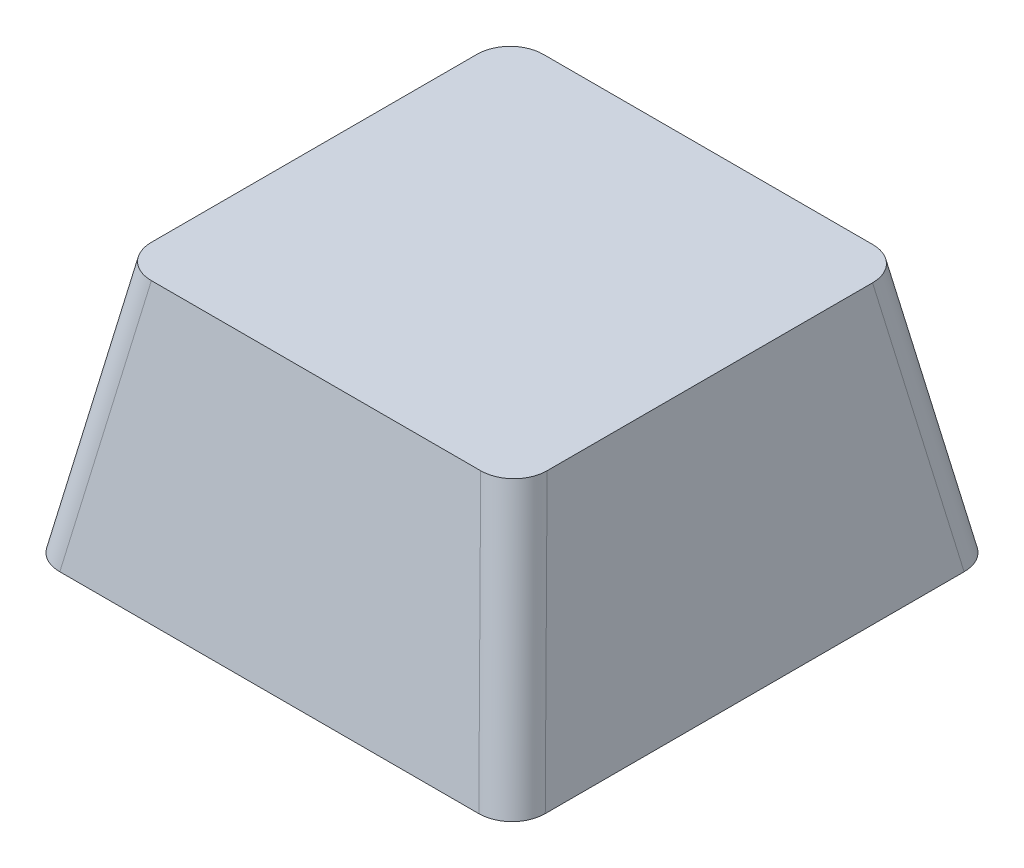
ISO-10303-21;
HEADER;
FILE_DESCRIPTION(('STEP AP214'),'2;1');
FILE_NAME('part.step','',(''),(''),'','','');
FILE_SCHEMA(('AUTOMOTIVE_DESIGN { 1 0 10303 214 1 1 1 1 }'));
ENDSEC;
DATA;
#1=APPLICATION_CONTEXT('core data for automotive mechanical design processes');
#2=APPLICATION_PROTOCOL_DEFINITION('international standard','automotive_design',2000,#1);
#3=PRODUCT_CONTEXT('',#1,'mechanical');
#4=PRODUCT('Part','Part','',(#3));
#5=PRODUCT_RELATED_PRODUCT_CATEGORY('part','',(#4));
#6=PRODUCT_DEFINITION_FORMATION('','',#4);
#7=PRODUCT_DEFINITION_CONTEXT('part definition',#1,'design');
#8=PRODUCT_DEFINITION('design','',#6,#7);
#9=PRODUCT_DEFINITION_SHAPE('','',#8);
#10=(LENGTH_UNIT() NAMED_UNIT(*) SI_UNIT(.MILLI.,.METRE.));
#11=(NAMED_UNIT(*) PLANE_ANGLE_UNIT() SI_UNIT($,.RADIAN.));
#12=(NAMED_UNIT(*) SI_UNIT($,.STERADIAN.) SOLID_ANGLE_UNIT());
#13=UNCERTAINTY_MEASURE_WITH_UNIT(LENGTH_MEASURE(1.E-05),#10,'distance_accuracy_value','');
#14=(GEOMETRIC_REPRESENTATION_CONTEXT(3) GLOBAL_UNCERTAINTY_ASSIGNED_CONTEXT((#13)) GLOBAL_UNIT_ASSIGNED_CONTEXT((#10,
#11,#12)) REPRESENTATION_CONTEXT('',''));
#15=CARTESIAN_POINT('',(0.,0.,0.));
#16=DIRECTION('',(0.,0.,1.));
#17=DIRECTION('',(1.,0.,0.));
#18=AXIS2_PLACEMENT_3D('',#15,#16,#17);
#19=CARTESIAN_POINT('',(0.,0.,0.));
#20=DIRECTION('',(0.,1.,0.));
#21=DIRECTION('',(0.,0.,1.));
#22=AXIS2_PLACEMENT_3D('',#19,#20,#21);
#23=PLANE('',#22);
#24=DIRECTION('',(0.,0.,-1.));
#25=VECTOR('',#24,1.);
#26=CARTESIAN_POINT('',(7.71473161158788,0.,0.));
#27=LINE('',#26,#25);
#28=CARTESIAN_POINT('',(7.71473161158788,0.,7.71306871926718));
#29=VERTEX_POINT('',#28);
#30=CARTESIAN_POINT('',(7.71473161158788,0.,-7.71306871926718));
#31=VERTEX_POINT('',#30);
#32=EDGE_CURVE('E148',#29,#31,#27,.T.);
#33=ORIENTED_EDGE('',*,*,#32,.T.);
#34=DIRECTION('',(-1.,0.,0.));
#35=VECTOR('',#34,1.);
#36=CARTESIAN_POINT('',(0.,0.,-7.71306871926718));
#37=LINE('',#36,#35);
#38=CARTESIAN_POINT('',(-7.71473161158788,0.,-7.71306871926718));
#39=VERTEX_POINT('',#38);
#40=EDGE_CURVE('E164',#31,#39,#37,.T.);
#41=ORIENTED_EDGE('',*,*,#40,.T.);
#42=DIRECTION('',(0.,0.,1.));
#43=VECTOR('',#42,1.);
#44=CARTESIAN_POINT('',(-7.71473161158788,0.,0.));
#45=LINE('',#44,#43);
#46=CARTESIAN_POINT('',(-7.71473161158788,0.,7.71306871926718));
#47=VERTEX_POINT('',#46);
#48=EDGE_CURVE('E171',#39,#47,#45,.T.);
#49=ORIENTED_EDGE('',*,*,#48,.T.);
#50=DIRECTION('',(1.,0.,0.));
#51=VECTOR('',#50,1.);
#52=CARTESIAN_POINT('',(0.,0.,7.71306871926718));
#53=LINE('',#52,#51);
#54=EDGE_CURVE('E58',#47,#29,#53,.T.);
#55=ORIENTED_EDGE('',*,*,#54,.T.);
#56=EDGE_LOOP('',(#33,#41,#49,#55));
#57=FACE_BOUND('',#56,.T.);
#58=DIRECTION('',(-1.,0.,0.));
#59=VECTOR('',#58,1.);
#60=CARTESIAN_POINT('',(-8.9845,0.,-8.9845));
#61=LINE('',#60,#59);
#62=CARTESIAN_POINT('',(7.75553729756677,0.,-8.9845));
#63=VERTEX_POINT('',#62);
#64=CARTESIAN_POINT('',(-7.75553729756678,0.,-8.9845));
#65=VERTEX_POINT('',#64);
#66=EDGE_CURVE('E221',#63,#65,#61,.T.);
#67=ORIENTED_EDGE('',*,*,#66,.F.);
#68=CARTESIAN_POINT('',(7.71473161158788,0.,-7.71306871926718));
#69=DIRECTION('',(0.,1.,0.));
#70=DIRECTION('',(0.692570896405918,0.,-0.72134981351041));
#71=AXIS2_PLACEMENT_3D('',#68,#69,#70);
#72=ELLIPSE('',#71,1.29087151252037,1.25);
#73=CARTESIAN_POINT('',(8.9845,0.,-7.75392784448938));
#74=VERTEX_POINT('',#73);
#75=EDGE_CURVE('E285',#63,#74,#72,.F.);
#76=ORIENTED_EDGE('',*,*,#75,.T.);
#77=DIRECTION('',(0.,0.,-1.));
#78=VECTOR('',#77,1.);
#79=CARTESIAN_POINT('',(8.9845,0.,-8.9845));
#80=LINE('',#79,#78);
#81=CARTESIAN_POINT('',(8.9845,0.,7.75392784448938));
#82=VERTEX_POINT('',#81);
#83=EDGE_CURVE('E324',#82,#74,#80,.T.);
#84=ORIENTED_EDGE('',*,*,#83,.F.);
#85=CARTESIAN_POINT('',(7.71473161158788,0.,7.71306871926718));
#86=DIRECTION('',(0.,1.,0.));
#87=DIRECTION('',(0.692570896405918,0.,0.72134981351041));
#88=AXIS2_PLACEMENT_3D('',#85,#86,#87);
#89=ELLIPSE('',#88,1.29087151252037,1.25);
#90=CARTESIAN_POINT('',(7.75553729756678,0.,8.9845));
#91=VERTEX_POINT('',#90);
#92=EDGE_CURVE('E281',#82,#91,#89,.F.);
#93=ORIENTED_EDGE('',*,*,#92,.T.);
#94=DIRECTION('',(1.,0.,0.));
#95=VECTOR('',#94,1.);
#96=CARTESIAN_POINT('',(-8.9845,0.,8.9845));
#97=LINE('',#96,#95);
#98=CARTESIAN_POINT('',(-7.75553729756678,0.,8.9845));
#99=VERTEX_POINT('',#98);
#100=EDGE_CURVE('E272',#99,#91,#97,.T.);
#101=ORIENTED_EDGE('',*,*,#100,.F.);
#102=CARTESIAN_POINT('',(-7.71473161158788,0.,7.71306871926718));
#103=DIRECTION('',(0.,1.,0.));
#104=DIRECTION('',(-0.692570896405918,0.,0.72134981351041));
#105=AXIS2_PLACEMENT_3D('',#102,#103,#104);
#106=ELLIPSE('',#105,1.29087151252037,1.25);
#107=CARTESIAN_POINT('',(-8.9845,0.,7.75392784448938));
#108=VERTEX_POINT('',#107);
#109=EDGE_CURVE('E274',#99,#108,#106,.F.);
#110=ORIENTED_EDGE('',*,*,#109,.T.);
#111=DIRECTION('',(0.,0.,1.));
#112=VECTOR('',#111,1.);
#113=CARTESIAN_POINT('',(-8.9845,0.,-8.9845));
#114=LINE('',#113,#112);
#115=CARTESIAN_POINT('',(-8.9845,0.,-7.75392784448938));
#116=VERTEX_POINT('',#115);
#117=EDGE_CURVE('E319',#116,#108,#114,.T.);
#118=ORIENTED_EDGE('',*,*,#117,.F.);
#119=CARTESIAN_POINT('',(-7.71473161158788,0.,-7.71306871926718));
#120=DIRECTION('',(0.,1.,0.));
#121=DIRECTION('',(-0.692570896405918,0.,-0.72134981351041));
#122=AXIS2_PLACEMENT_3D('',#119,#120,#121);
#123=ELLIPSE('',#122,1.29087151252037,1.25);
#124=EDGE_CURVE('E276',#116,#65,#123,.F.);
#125=ORIENTED_EDGE('',*,*,#124,.T.);
#126=EDGE_LOOP('',(#67,#76,#84,#93,#101,#110,#118,#125));
#127=FACE_BOUND('',#126,.T.);
#128=ADVANCED_FACE('F43',(#57,#127),#23,.F.);
#129=CARTESIAN_POINT('',(0.,9.3,0.));
#130=DIRECTION('',(0.,1.,0.));
#131=DIRECTION('',(0.,0.,1.));
#132=AXIS2_PLACEMENT_3D('',#129,#130,#131);
#133=PLANE('',#132);
#134=DIRECTION('',(0.,0.,-1.));
#135=VECTOR('',#134,1.);
#136=CARTESIAN_POINT('',(7.324,9.3,-7.255));
#137=LINE('',#136,#135);
#138=CARTESIAN_POINT('',(7.324,9.3,6.02442784448938));
#139=VERTEX_POINT('',#138);
#140=CARTESIAN_POINT('',(7.324,9.3,-6.02442784448938));
#141=VERTEX_POINT('',#140);
#142=EDGE_CURVE('E297',#139,#141,#137,.T.);
#143=ORIENTED_EDGE('',*,*,#142,.T.);
#144=CARTESIAN_POINT('',(6.05423161158788,9.3,-5.98356871926718));
#145=DIRECTION('',(0.,1.,0.));
#146=DIRECTION('',(0.692570896405918,0.,-0.72134981351041));
#147=AXIS2_PLACEMENT_3D('',#144,#145,#146);
#148=ELLIPSE('',#147,1.29087151252037,1.25);
#149=CARTESIAN_POINT('',(6.09503729756677,9.3,-7.255));
#150=VERTEX_POINT('',#149);
#151=EDGE_CURVE('E355',#141,#150,#148,.T.);
#152=ORIENTED_EDGE('',*,*,#151,.T.);
#153=DIRECTION('',(-1.,0.,0.));
#154=VECTOR('',#153,1.);
#155=CARTESIAN_POINT('',(-7.324,9.3,-7.255));
#156=LINE('',#155,#154);
#157=CARTESIAN_POINT('',(-6.09503729756677,9.3,-7.255));
#158=VERTEX_POINT('',#157);
#159=EDGE_CURVE('E322',#150,#158,#156,.T.);
#160=ORIENTED_EDGE('',*,*,#159,.T.);
#161=CARTESIAN_POINT('',(-6.05423161158788,9.3,-5.98356871926717));
#162=DIRECTION('',(0.,1.,0.));
#163=DIRECTION('',(-0.692570896405918,0.,-0.72134981351041));
#164=AXIS2_PLACEMENT_3D('',#161,#162,#163);
#165=ELLIPSE('',#164,1.29087151252037,1.25);
#166=CARTESIAN_POINT('',(-7.324,9.3,-6.02442784448938));
#167=VERTEX_POINT('',#166);
#168=EDGE_CURVE('E363',#158,#167,#165,.T.);
#169=ORIENTED_EDGE('',*,*,#168,.T.);
#170=DIRECTION('',(0.,0.,1.));
#171=VECTOR('',#170,1.);
#172=CARTESIAN_POINT('',(-7.324,9.3,-7.255));
#173=LINE('',#172,#171);
#174=CARTESIAN_POINT('',(-7.324,9.3,6.02442784448938));
#175=VERTEX_POINT('',#174);
#176=EDGE_CURVE('E165',#167,#175,#173,.T.);
#177=ORIENTED_EDGE('',*,*,#176,.T.);
#178=CARTESIAN_POINT('',(-6.05423161158788,9.3,5.98356871926717));
#179=DIRECTION('',(0.,1.,0.));
#180=DIRECTION('',(-0.692570896405918,0.,0.72134981351041));
#181=AXIS2_PLACEMENT_3D('',#178,#179,#180);
#182=ELLIPSE('',#181,1.29087151252037,1.25);
#183=CARTESIAN_POINT('',(-6.09503729756677,9.3,7.255));
#184=VERTEX_POINT('',#183);
#185=EDGE_CURVE('E367',#175,#184,#182,.T.);
#186=ORIENTED_EDGE('',*,*,#185,.T.);
#187=DIRECTION('',(1.,0.,0.));
#188=VECTOR('',#187,1.);
#189=CARTESIAN_POINT('',(-7.324,9.3,7.255));
#190=LINE('',#189,#188);
#191=CARTESIAN_POINT('',(6.09503729756677,9.3,7.255));
#192=VERTEX_POINT('',#191);
#193=EDGE_CURVE('E315',#184,#192,#190,.T.);
#194=ORIENTED_EDGE('',*,*,#193,.T.);
#195=CARTESIAN_POINT('',(6.05423161158788,9.3,5.98356871926717));
#196=DIRECTION('',(0.,1.,0.));
#197=DIRECTION('',(0.692570896405918,0.,0.72134981351041));
#198=AXIS2_PLACEMENT_3D('',#195,#196,#197);
#199=ELLIPSE('',#198,1.29087151252037,1.25);
#200=EDGE_CURVE('E359',#192,#139,#199,.T.);
#201=ORIENTED_EDGE('',*,*,#200,.T.);
#202=EDGE_LOOP('',(#143,#152,#160,#169,#177,#186,#194,#201));
#203=FACE_BOUND('',#202,.T.);
#204=ADVANCED_FACE('F194',(#203),#133,.T.);
#205=CARTESIAN_POINT('',(0.,1.61497488433886,-8.68416676747698));
#206=DIRECTION('',(0.,0.182833064548617,-0.983143972421009));
#207=DIRECTION('',(0.,0.983143972421009,0.182833064548617));
#208=AXIS2_PLACEMENT_3D('',#205,#206,#207);
#209=PLANE('',#208);
#210=ORIENTED_EDGE('',*,*,#159,.F.);
#211=DIRECTION('',(0.172895196544548,-0.968338047494308,-0.180079640122732));
#212=VECTOR('',#211,1.);
#213=CARTESIAN_POINT('',(7.24397141593191,2.86513863246263,-8.45167663818881));
#214=LINE('',#213,#212);
#215=EDGE_CURVE('E277',#150,#63,#214,.T.);
#216=ORIENTED_EDGE('',*,*,#215,.T.);
#217=ORIENTED_EDGE('',*,*,#66,.T.);
#218=DIRECTION('',(-0.172895196544548,-0.968338047494308,-0.180079640122732));
#219=VECTOR('',#218,1.);
#220=CARTESIAN_POINT('',(-7.24397141593191,2.86513863246263,-8.45167663818881));
#221=LINE('',#220,#219);
#222=EDGE_CURVE('E417',#65,#158,#221,.F.);
#223=ORIENTED_EDGE('',*,*,#222,.T.);
#224=EDGE_LOOP('',(#210,#216,#217,#223));
#225=FACE_BOUND('',#224,.T.);
#226=ADVANCED_FACE('F183',(#225),#209,.T.);
#227=CARTESIAN_POINT('',(-8.70692728071728,1.55460782254097,0.));
#228=DIRECTION('',(-0.984431500585045,0.175768656636717,0.));
#229=DIRECTION('',(-0.175768656636717,-0.984431500585045,0.));
#230=AXIS2_PLACEMENT_3D('',#227,#228,#229);
#231=PLANE('',#230);
#232=ORIENTED_EDGE('',*,*,#176,.F.);
#233=DIRECTION('',(-0.172895196544548,-0.968338047494308,-0.180079640122732));
#234=VECTOR('',#233,1.);
#235=CARTESIAN_POINT('',(-8.47451079166322,2.85630812257276,-7.22274667266254));
#236=LINE('',#235,#234);
#237=EDGE_CURVE('E51',#167,#116,#236,.T.);
#238=ORIENTED_EDGE('',*,*,#237,.T.);
#239=ORIENTED_EDGE('',*,*,#117,.T.);
#240=DIRECTION('',(-0.172895196544548,-0.968338047494308,0.180079640122732));
#241=VECTOR('',#240,1.);
#242=CARTESIAN_POINT('',(-8.47451079166322,2.85630812257276,7.22274667266254));
#243=LINE('',#242,#241);
#244=EDGE_CURVE('E343',#108,#175,#243,.F.);
#245=ORIENTED_EDGE('',*,*,#244,.T.);
#246=EDGE_LOOP('',(#232,#238,#239,#245));
#247=FACE_BOUND('',#246,.T.);
#248=ADVANCED_FACE('F193',(#247),#231,.T.);
#249=CARTESIAN_POINT('',(8.70692728071728,1.55460782254097,0.));
#250=DIRECTION('',(0.984431500585045,0.175768656636717,0.));
#251=DIRECTION('',(-0.175768656636717,0.984431500585045,0.));
#252=AXIS2_PLACEMENT_3D('',#249,#250,#251);
#253=PLANE('',#252);
#254=ORIENTED_EDGE('',*,*,#83,.T.);
#255=DIRECTION('',(0.172895196544548,-0.968338047494309,-0.180079640122732));
#256=VECTOR('',#255,1.);
#257=CARTESIAN_POINT('',(8.47451079166322,2.85630812257276,-7.22274667266254));
#258=LINE('',#257,#256);
#259=EDGE_CURVE('E371',#74,#141,#258,.F.);
#260=ORIENTED_EDGE('',*,*,#259,.T.);
#261=ORIENTED_EDGE('',*,*,#142,.F.);
#262=DIRECTION('',(0.172895196544548,-0.968338047494308,0.180079640122732));
#263=VECTOR('',#262,1.);
#264=CARTESIAN_POINT('',(8.47451079166322,2.85630812257276,7.22274667266254));
#265=LINE('',#264,#263);
#266=EDGE_CURVE('E289',#139,#82,#265,.T.);
#267=ORIENTED_EDGE('',*,*,#266,.T.);
#268=EDGE_LOOP('',(#254,#260,#261,#267));
#269=FACE_BOUND('',#268,.T.);
#270=ADVANCED_FACE('F405',(#269),#253,.T.);
#271=CARTESIAN_POINT('',(0.,1.61497488433887,8.68416676747698));
#272=DIRECTION('',(0.,0.182833064548617,0.983143972421009));
#273=DIRECTION('',(0.,-0.983143972421009,0.182833064548617));
#274=AXIS2_PLACEMENT_3D('',#271,#272,#273);
#275=PLANE('',#274);
#276=ORIENTED_EDGE('',*,*,#100,.T.);
#277=DIRECTION('',(0.172895196544548,-0.968338047494308,0.180079640122732));
#278=VECTOR('',#277,1.);
#279=CARTESIAN_POINT('',(7.24397141593191,2.86513863246263,8.45167663818881));
#280=LINE('',#279,#278);
#281=EDGE_CURVE('E66',#91,#192,#280,.F.);
#282=ORIENTED_EDGE('',*,*,#281,.T.);
#283=ORIENTED_EDGE('',*,*,#193,.F.);
#284=DIRECTION('',(-0.172895196544548,-0.968338047494308,0.180079640122732));
#285=VECTOR('',#284,1.);
#286=CARTESIAN_POINT('',(-7.24397141593191,2.86513863246264,8.4516766381888));
#287=LINE('',#286,#285);
#288=EDGE_CURVE('E350',#184,#99,#287,.T.);
#289=ORIENTED_EDGE('',*,*,#288,.T.);
#290=EDGE_LOOP('',(#276,#282,#283,#289));
#291=FACE_BOUND('',#290,.T.);
#292=ADVANCED_FACE('F250',(#291),#275,.T.);
#293=CARTESIAN_POINT('',(7.24397141593191,2.63659730177686,-7.22274667266254));
#294=DIRECTION('',(0.172895196544548,-0.968338047494309,-0.180079640122732));
#295=DIRECTION('',(0.,0.182833064548617,-0.983143972421009));
#296=AXIS2_PLACEMENT_3D('',#293,#294,#295);
#297=CYLINDRICAL_SURFACE('',#296,1.25);
#298=ORIENTED_EDGE('',*,*,#151,.F.);
#299=ORIENTED_EDGE('',*,*,#259,.F.);
#300=ORIENTED_EDGE('',*,*,#75,.F.);
#301=ORIENTED_EDGE('',*,*,#215,.F.);
#302=EDGE_LOOP('',(#298,#299,#300,#301));
#303=FACE_BOUND('',#302,.T.);
#304=ADVANCED_FACE('F252',(#303),#297,.T.);
#305=CARTESIAN_POINT('',(7.24397141593191,2.63659730177686,7.22274667266254));
#306=DIRECTION('',(0.172895196544548,-0.968338047494308,0.180079640122732));
#307=DIRECTION('',(0.,-0.182833064548617,-0.983143972421009));
#308=AXIS2_PLACEMENT_3D('',#305,#306,#307);
#309=CYLINDRICAL_SURFACE('',#308,1.25);
#310=ORIENTED_EDGE('',*,*,#200,.F.);
#311=ORIENTED_EDGE('',*,*,#281,.F.);
#312=ORIENTED_EDGE('',*,*,#92,.F.);
#313=ORIENTED_EDGE('',*,*,#266,.F.);
#314=EDGE_LOOP('',(#310,#311,#312,#313));
#315=FACE_BOUND('',#314,.T.);
#316=ADVANCED_FACE('F454',(#315),#309,.T.);
#317=CARTESIAN_POINT('',(-7.24397141593191,2.63659730177686,-7.22274667266254));
#318=DIRECTION('',(-0.172895196544548,-0.968338047494308,-0.180079640122732));
#319=DIRECTION('',(0.,0.182833064548617,-0.983143972421009));
#320=AXIS2_PLACEMENT_3D('',#317,#318,#319);
#321=CYLINDRICAL_SURFACE('',#320,1.25);
#322=ORIENTED_EDGE('',*,*,#168,.F.);
#323=ORIENTED_EDGE('',*,*,#222,.F.);
#324=ORIENTED_EDGE('',*,*,#124,.F.);
#325=ORIENTED_EDGE('',*,*,#237,.F.);
#326=EDGE_LOOP('',(#322,#323,#324,#325));
#327=FACE_BOUND('',#326,.T.);
#328=ADVANCED_FACE('F460',(#327),#321,.T.);
#329=CARTESIAN_POINT('',(-7.24397141593191,2.63659730177686,7.22274667266254));
#330=DIRECTION('',(-0.172895196544548,-0.968338047494308,0.180079640122732));
#331=DIRECTION('',(0.,-0.182833064548617,-0.983143972421009));
#332=AXIS2_PLACEMENT_3D('',#329,#330,#331);
#333=CYLINDRICAL_SURFACE('',#332,1.25);
#334=ORIENTED_EDGE('',*,*,#185,.F.);
#335=ORIENTED_EDGE('',*,*,#244,.F.);
#336=ORIENTED_EDGE('',*,*,#109,.F.);
#337=ORIENTED_EDGE('',*,*,#288,.F.);
#338=EDGE_LOOP('',(#334,#335,#336,#337));
#339=FACE_BOUND('',#338,.T.);
#340=ADVANCED_FACE('F45',(#339),#333,.T.);
#341=CARTESIAN_POINT('',(0.,8.05,0.));
#342=DIRECTION('',(0.,1.,0.));
#343=DIRECTION('',(0.,0.,1.));
#344=AXIS2_PLACEMENT_3D('',#341,#342,#343);
#345=PLANE('',#344);
#346=CARTESIAN_POINT('',(0.,8.05000000002565,0.));
#347=DIRECTION('',(0.,1.,0.));
#348=DIRECTION('',(0.,0.,1.));
#349=AXIS2_PLACEMENT_3D('',#346,#347,#348);
#350=CIRCLE('',#349,2.8);
#351=CARTESIAN_POINT('',(0.,8.05000000002565,2.8));
#352=VERTEX_POINT('',#351);
#353=EDGE_CURVE('E12',#352,#352,#350,.F.);
#354=ORIENTED_EDGE('',*,*,#353,.F.);
#355=EDGE_LOOP('',(#354));
#356=FACE_BOUND('',#355,.T.);
#357=DIRECTION('',(0.,0.,-1.));
#358=VECTOR('',#357,1.);
#359=CARTESIAN_POINT('',(6.27741709545885,8.05,0.));
#360=LINE('',#359,#358);
#361=CARTESIAN_POINT('',(6.27741709545885,8.05,6.21602839668653));
#362=VERTEX_POINT('',#361);
#363=CARTESIAN_POINT('',(6.27741709545885,8.05,-6.21602839668653));
#364=VERTEX_POINT('',#363);
#365=EDGE_CURVE('E134',#362,#364,#360,.T.);
#366=ORIENTED_EDGE('',*,*,#365,.F.);
#367=DIRECTION('',(1.,0.,0.));
#368=VECTOR('',#367,1.);
#369=CARTESIAN_POINT('',(0.,8.05,6.21602839668653));
#370=LINE('',#369,#368);
#371=CARTESIAN_POINT('',(-6.27741709545885,8.05,6.21602839668653));
#372=VERTEX_POINT('',#371);
#373=EDGE_CURVE('E138',#372,#362,#370,.T.);
#374=ORIENTED_EDGE('',*,*,#373,.F.);
#375=DIRECTION('',(0.,0.,1.));
#376=VECTOR('',#375,1.);
#377=CARTESIAN_POINT('',(-6.27741709545885,8.05,0.));
#378=LINE('',#377,#376);
#379=CARTESIAN_POINT('',(-6.27741709545885,8.05,-6.21602839668653));
#380=VERTEX_POINT('',#379);
#381=EDGE_CURVE('E154',#380,#372,#378,.T.);
#382=ORIENTED_EDGE('',*,*,#381,.F.);
#383=DIRECTION('',(-1.,0.,0.));
#384=VECTOR('',#383,1.);
#385=CARTESIAN_POINT('',(0.,8.05,-6.21602839668653));
#386=LINE('',#385,#384);
#387=EDGE_CURVE('E140',#364,#380,#386,.T.);
#388=ORIENTED_EDGE('',*,*,#387,.F.);
#389=EDGE_LOOP('',(#366,#374,#382,#388));
#390=FACE_BOUND('',#389,.T.);
#391=ADVANCED_FACE('F136',(#356,#390),#345,.F.);
#392=CARTESIAN_POINT('',(0.,1.38643355365309,-7.45523680195072));
#393=DIRECTION('',(0.,0.182833064548617,-0.983143972421009));
#394=DIRECTION('',(0.,0.983143972421009,0.182833064548617));
#395=AXIS2_PLACEMENT_3D('',#392,#393,#394);
#396=PLANE('',#395);
#397=ORIENTED_EDGE('',*,*,#387,.T.);
#398=DIRECTION('',(0.172895196544548,0.968338047494308,0.180079640122732));
#399=VECTOR('',#398,1.);
#400=CARTESIAN_POINT('',(-7.24397141593191,2.63659730177686,-7.22274667266254));
#401=LINE('',#400,#399);
#402=EDGE_CURVE('E161',#39,#380,#401,.T.);
#403=ORIENTED_EDGE('',*,*,#402,.F.);
#404=ORIENTED_EDGE('',*,*,#40,.F.);
#405=DIRECTION('',(-0.172895196544548,0.968338047494309,0.180079640122732));
#406=VECTOR('',#405,1.);
#407=CARTESIAN_POINT('',(7.24397141593191,2.63659730177686,-7.22274667266254));
#408=LINE('',#407,#406);
#409=EDGE_CURVE('E150',#31,#364,#408,.T.);
#410=ORIENTED_EDGE('',*,*,#409,.T.);
#411=EDGE_LOOP('',(#397,#403,#404,#410));
#412=FACE_BOUND('',#411,.T.);
#413=ADVANCED_FACE('F478',(#412),#396,.F.);
#414=CARTESIAN_POINT('',(-7.47638790498598,1.33489700174508,0.));
#415=DIRECTION('',(-0.984431500585045,0.175768656636717,0.));
#416=DIRECTION('',(-0.175768656636717,-0.984431500585045,0.));
#417=AXIS2_PLACEMENT_3D('',#414,#415,#416);
#418=PLANE('',#417);
#419=ORIENTED_EDGE('',*,*,#381,.T.);
#420=DIRECTION('',(0.172895196544548,0.968338047494308,-0.180079640122732));
#421=VECTOR('',#420,1.);
#422=CARTESIAN_POINT('',(-7.24397141593191,2.63659730177686,7.22274667266254));
#423=LINE('',#422,#421);
#424=EDGE_CURVE('E149',#47,#372,#423,.T.);
#425=ORIENTED_EDGE('',*,*,#424,.F.);
#426=ORIENTED_EDGE('',*,*,#48,.F.);
#427=ORIENTED_EDGE('',*,*,#402,.T.);
#428=EDGE_LOOP('',(#419,#425,#426,#427));
#429=FACE_BOUND('',#428,.T.);
#430=ADVANCED_FACE('F488',(#429),#418,.F.);
#431=CARTESIAN_POINT('',(7.47638790498598,1.33489700174508,0.));
#432=DIRECTION('',(0.984431500585045,0.175768656636717,0.));
#433=DIRECTION('',(-0.175768656636717,0.984431500585045,0.));
#434=AXIS2_PLACEMENT_3D('',#431,#432,#433);
#435=PLANE('',#434);
#436=ORIENTED_EDGE('',*,*,#32,.F.);
#437=DIRECTION('',(-0.172895196544548,0.968338047494308,-0.180079640122732));
#438=VECTOR('',#437,1.);
#439=CARTESIAN_POINT('',(7.24397141593191,2.63659730177686,7.22274667266254));
#440=LINE('',#439,#438);
#441=EDGE_CURVE('E145',#29,#362,#440,.T.);
#442=ORIENTED_EDGE('',*,*,#441,.T.);
#443=ORIENTED_EDGE('',*,*,#365,.T.);
#444=ORIENTED_EDGE('',*,*,#409,.F.);
#445=EDGE_LOOP('',(#436,#442,#443,#444));
#446=FACE_BOUND('',#445,.T.);
#447=ADVANCED_FACE('F146',(#446),#435,.F.);
#448=CARTESIAN_POINT('',(0.,1.3864335536531,7.45523680195072));
#449=DIRECTION('',(0.,0.182833064548617,0.983143972421009));
#450=DIRECTION('',(0.,-0.983143972421009,0.182833064548617));
#451=AXIS2_PLACEMENT_3D('',#448,#449,#450);
#452=PLANE('',#451);
#453=ORIENTED_EDGE('',*,*,#54,.F.);
#454=ORIENTED_EDGE('',*,*,#424,.T.);
#455=ORIENTED_EDGE('',*,*,#373,.T.);
#456=ORIENTED_EDGE('',*,*,#441,.F.);
#457=EDGE_LOOP('',(#453,#454,#455,#456));
#458=FACE_BOUND('',#457,.T.);
#459=ADVANCED_FACE('F152',(#458),#452,.F.);
#460=CARTESIAN_POINT('',(0.,0.6,0.));
#461=DIRECTION('',(0.,1.,0.));
#462=DIRECTION('',(0.,0.,1.));
#463=AXIS2_PLACEMENT_3D('',#460,#461,#462);
#464=PLANE('',#463);
#465=CARTESIAN_POINT('',(0.,0.6,0.));
#466=DIRECTION('',(0.,1.,0.));
#467=DIRECTION('',(0.,0.,1.));
#468=AXIS2_PLACEMENT_3D('',#465,#466,#467);
#469=CIRCLE('',#468,2.4);
#470=CARTESIAN_POINT('',(0.,0.6,2.4));
#471=VERTEX_POINT('',#470);
#472=EDGE_CURVE('E583',#471,#471,#469,.T.);
#473=ORIENTED_EDGE('',*,*,#472,.T.);
#474=EDGE_LOOP('',(#473));
#475=FACE_BOUND('',#474,.T.);
#476=CARTESIAN_POINT('',(0.,0.6,0.));
#477=DIRECTION('',(0.,1.,0.));
#478=DIRECTION('',(0.,0.,1.));
#479=AXIS2_PLACEMENT_3D('',#476,#477,#478);
#480=CIRCLE('',#479,2.8);
#481=CARTESIAN_POINT('',(0.,0.6,2.8));
#482=VERTEX_POINT('',#481);
#483=EDGE_CURVE('E156',#482,#482,#480,.T.);
#484=ORIENTED_EDGE('',*,*,#483,.F.);
#485=EDGE_LOOP('',(#484));
#486=FACE_BOUND('',#485,.T.);
#487=ADVANCED_FACE('F508',(#475,#486),#464,.F.);
#488=CARTESIAN_POINT('',(0.,500000.,0.));
#489=DIRECTION('',(0.,-1.,0.));
#490=DIRECTION('',(0.,0.,-1.));
#491=AXIS2_PLACEMENT_3D('',#488,#489,#490);
#492=CYLINDRICAL_SURFACE('',#491,2.8);
#493=ORIENTED_EDGE('',*,*,#483,.T.);
#494=EDGE_LOOP('',(#493));
#495=FACE_BOUND('',#494,.T.);
#496=ORIENTED_EDGE('',*,*,#353,.T.);
#497=EDGE_LOOP('',(#496));
#498=FACE_BOUND('',#497,.T.);
#499=ADVANCED_FACE('F509',(#495,#498),#492,.T.);
#500=CARTESIAN_POINT('',(0.,6.6,0.));
#501=DIRECTION('',(0.,-1.,0.));
#502=DIRECTION('',(0.,0.,-1.));
#503=AXIS2_PLACEMENT_3D('',#500,#501,#502);
#504=CYLINDRICAL_SURFACE('',#503,2.4);
#505=CARTESIAN_POINT('',(0.,6.6,0.));
#506=DIRECTION('',(0.,1.,0.));
#507=DIRECTION('',(0.,0.,1.));
#508=AXIS2_PLACEMENT_3D('',#505,#506,#507);
#509=CIRCLE('',#508,2.4);
#510=CARTESIAN_POINT('',(0.,6.6,2.4));
#511=VERTEX_POINT('',#510);
#512=EDGE_CURVE('E582',#511,#511,#509,.T.);
#513=ORIENTED_EDGE('',*,*,#512,.T.);
#514=EDGE_LOOP('',(#513));
#515=FACE_BOUND('',#514,.T.);
#516=ORIENTED_EDGE('',*,*,#472,.F.);
#517=EDGE_LOOP('',(#516));
#518=FACE_BOUND('',#517,.T.);
#519=ADVANCED_FACE('F517',(#515,#518),#504,.F.);
#520=CARTESIAN_POINT('',(0.,6.6,0.));
#521=DIRECTION('',(0.,1.,0.));
#522=DIRECTION('',(0.,0.,1.));
#523=AXIS2_PLACEMENT_3D('',#520,#521,#522);
#524=PLANE('',#523);
#525=ORIENTED_EDGE('',*,*,#512,.F.);
#526=EDGE_LOOP('',(#525));
#527=FACE_BOUND('',#526,.T.);
#528=ADVANCED_FACE('F529',(#527),#524,.F.);
#529=CLOSED_SHELL('',(#128,#204,#226,#248,#270,#292,#304,#316,#328,#340,#391,#413,#430,#447,
#459,#487,#499,#519,#528));
#530=MANIFOLD_SOLID_BREP('B2',#529);
#531=ADVANCED_BREP_SHAPE_REPRESENTATION('',(#18,#530),#14);
#532=SHAPE_DEFINITION_REPRESENTATION(#9,#531);
ENDSEC;
END-ISO-10303-21;
